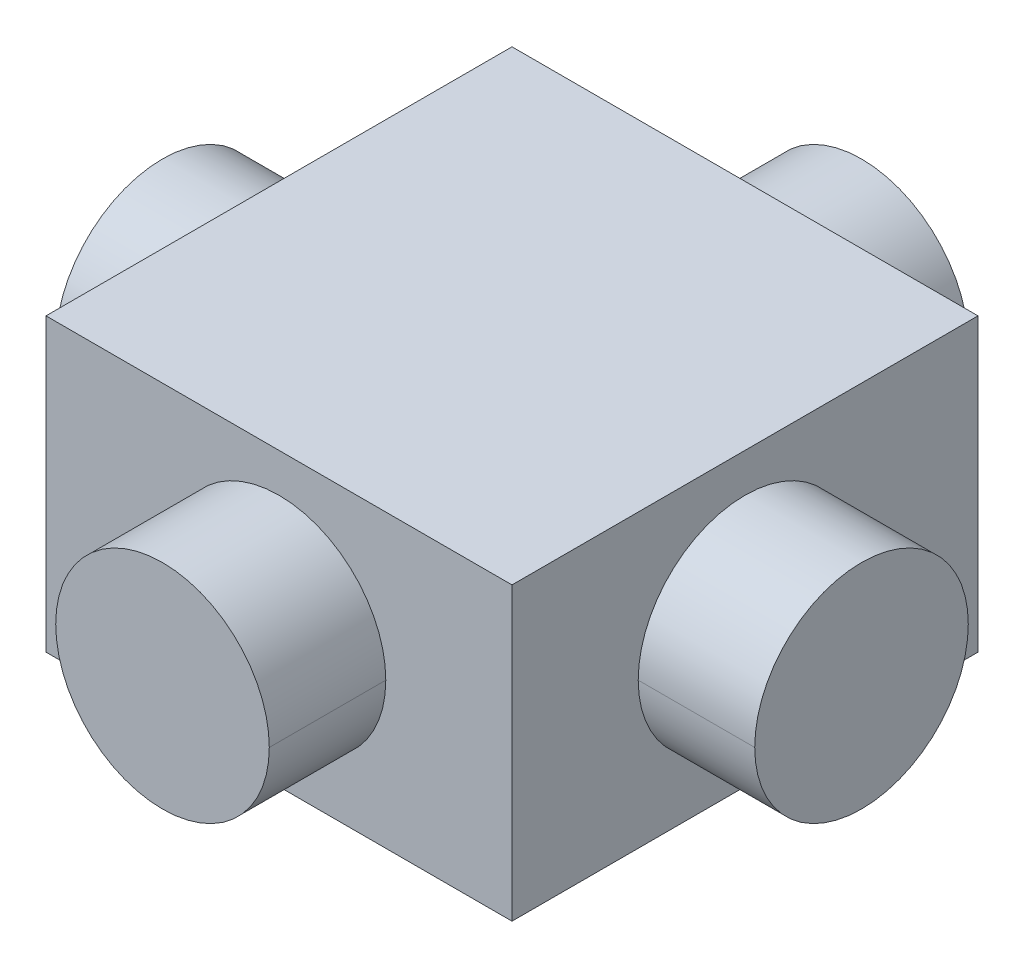
ISO-10303-21;
HEADER;
FILE_DESCRIPTION(('STEP AP214'),'2;1');
FILE_NAME('part.step','',(''),(''),'','','');
FILE_SCHEMA(('AUTOMOTIVE_DESIGN { 1 0 10303 214 1 1 1 1 }'));
ENDSEC;
DATA;
#1=APPLICATION_CONTEXT('core data for automotive mechanical design processes');
#2=APPLICATION_PROTOCOL_DEFINITION('international standard','automotive_design',2000,#1);
#3=PRODUCT_CONTEXT('',#1,'mechanical');
#4=PRODUCT('Part','Part','',(#3));
#5=PRODUCT_RELATED_PRODUCT_CATEGORY('part','',(#4));
#6=PRODUCT_DEFINITION_FORMATION('','',#4);
#7=PRODUCT_DEFINITION_CONTEXT('part definition',#1,'design');
#8=PRODUCT_DEFINITION('design','',#6,#7);
#9=PRODUCT_DEFINITION_SHAPE('','',#8);
#10=(LENGTH_UNIT() NAMED_UNIT(*) SI_UNIT(.MILLI.,.METRE.));
#11=(NAMED_UNIT(*) PLANE_ANGLE_UNIT() SI_UNIT($,.RADIAN.));
#12=(NAMED_UNIT(*) SI_UNIT($,.STERADIAN.) SOLID_ANGLE_UNIT());
#13=UNCERTAINTY_MEASURE_WITH_UNIT(LENGTH_MEASURE(1.E-05),#10,'distance_accuracy_value','');
#14=(GEOMETRIC_REPRESENTATION_CONTEXT(3) GLOBAL_UNCERTAINTY_ASSIGNED_CONTEXT((#13)) GLOBAL_UNIT_ASSIGNED_CONTEXT((#10,
#11,#12)) REPRESENTATION_CONTEXT('',''));
#15=CARTESIAN_POINT('',(0.,0.,0.));
#16=DIRECTION('',(0.,0.,1.));
#17=DIRECTION('',(1.,0.,0.));
#18=AXIS2_PLACEMENT_3D('',#15,#16,#17);
#19=CARTESIAN_POINT('',(3.6,0.,0.));
#20=DIRECTION('',(-1.,0.,0.));
#21=DIRECTION('',(0.,0.,1.));
#22=AXIS2_PLACEMENT_3D('',#19,#20,#21);
#23=CYLINDRICAL_SURFACE('',#22,1.1);
#24=DIRECTION('',(-1.,0.,0.));
#25=VECTOR('',#24,1.);
#26=CARTESIAN_POINT('',(3.6,0.,-1.10000000000001));
#27=LINE('',#26,#25);
#28=CARTESIAN_POINT('',(-2.4,0.,-1.1));
#29=VERTEX_POINT('',#28);
#30=CARTESIAN_POINT('',(-3.6,0.,-1.09999999999999));
#31=VERTEX_POINT('',#30);
#32=EDGE_CURVE('E186',#29,#31,#27,.T.);
#33=ORIENTED_EDGE('',*,*,#32,.F.);
#34=CARTESIAN_POINT('',(-2.4,0.,0.));
#35=DIRECTION('',(-1.,0.,0.));
#36=DIRECTION('',(0.,0.,1.));
#37=AXIS2_PLACEMENT_3D('',#34,#35,#36);
#38=CIRCLE('',#37,1.1);
#39=CARTESIAN_POINT('',(-2.4,0.,1.1));
#40=VERTEX_POINT('',#39);
#41=EDGE_CURVE('E182',#29,#40,#38,.T.);
#42=ORIENTED_EDGE('',*,*,#41,.T.);
#43=DIRECTION('',(-1.,0.,0.));
#44=VECTOR('',#43,1.);
#45=CARTESIAN_POINT('',(3.6,0.,1.09999999999999));
#46=LINE('',#45,#44);
#47=CARTESIAN_POINT('',(-3.6,0.,1.10000000000001));
#48=VERTEX_POINT('',#47);
#49=EDGE_CURVE('E205',#40,#48,#46,.T.);
#50=ORIENTED_EDGE('',*,*,#49,.T.);
#51=CARTESIAN_POINT('',(-3.6,0.,0.));
#52=DIRECTION('',(1.,0.,0.));
#53=DIRECTION('',(0.,0.,-1.));
#54=AXIS2_PLACEMENT_3D('',#51,#52,#53);
#55=CIRCLE('',#54,1.1);
#56=EDGE_CURVE('E11',#48,#31,#55,.T.);
#57=ORIENTED_EDGE('',*,*,#56,.T.);
#58=EDGE_LOOP('',(#33,#42,#50,#57));
#59=FACE_BOUND('',#58,.T.);
#60=ADVANCED_FACE('F16',(#59),#23,.T.);
#61=CARTESIAN_POINT('',(-3.6,0.,0.));
#62=DIRECTION('',(1.,0.,0.));
#63=DIRECTION('',(0.,0.,-1.));
#64=AXIS2_PLACEMENT_3D('',#61,#62,#63);
#65=PLANE('',#64);
#66=ORIENTED_EDGE('',*,*,#56,.F.);
#67=CARTESIAN_POINT('',(-3.6,0.,0.));
#68=DIRECTION('',(1.,0.,0.));
#69=DIRECTION('',(0.,0.,-1.));
#70=AXIS2_PLACEMENT_3D('',#67,#68,#69);
#71=CIRCLE('',#70,1.1);
#72=EDGE_CURVE('E189',#31,#48,#71,.T.);
#73=ORIENTED_EDGE('',*,*,#72,.F.);
#74=EDGE_LOOP('',(#66,#73));
#75=FACE_BOUND('',#74,.T.);
#76=ADVANCED_FACE('F310',(#75),#65,.F.);
#77=CARTESIAN_POINT('',(0.,0.,3.6));
#78=DIRECTION('',(0.,0.,-1.));
#79=DIRECTION('',(-1.,0.,0.));
#80=AXIS2_PLACEMENT_3D('',#77,#78,#79);
#81=CYLINDRICAL_SURFACE('',#80,1.1);
#82=DIRECTION('',(0.,0.,-1.));
#83=VECTOR('',#82,1.);
#84=CARTESIAN_POINT('',(1.1,0.,3.6));
#85=LINE('',#84,#83);
#86=CARTESIAN_POINT('',(1.1,0.,-2.4));
#87=VERTEX_POINT('',#86);
#88=CARTESIAN_POINT('',(1.1,0.,-3.6));
#89=VERTEX_POINT('',#88);
#90=EDGE_CURVE('E217',#87,#89,#85,.T.);
#91=ORIENTED_EDGE('',*,*,#90,.F.);
#92=CARTESIAN_POINT('',(0.,0.,-2.4));
#93=DIRECTION('',(0.,0.,1.));
#94=DIRECTION('',(1.,0.,0.));
#95=AXIS2_PLACEMENT_3D('',#92,#93,#94);
#96=CIRCLE('',#95,1.1);
#97=CARTESIAN_POINT('',(-1.1,0.,-2.4));
#98=VERTEX_POINT('',#97);
#99=EDGE_CURVE('E185',#98,#87,#96,.T.);
#100=ORIENTED_EDGE('',*,*,#99,.F.);
#101=DIRECTION('',(0.,0.,-1.));
#102=VECTOR('',#101,1.);
#103=CARTESIAN_POINT('',(-1.1,0.,3.6));
#104=LINE('',#103,#102);
#105=CARTESIAN_POINT('',(-1.1,0.,-3.6));
#106=VERTEX_POINT('',#105);
#107=EDGE_CURVE('E216',#98,#106,#104,.T.);
#108=ORIENTED_EDGE('',*,*,#107,.T.);
#109=CARTESIAN_POINT('',(0.,0.,-3.6));
#110=DIRECTION('',(0.,0.,1.));
#111=DIRECTION('',(1.,0.,0.));
#112=AXIS2_PLACEMENT_3D('',#109,#110,#111);
#113=CIRCLE('',#112,1.1);
#114=EDGE_CURVE('E27',#106,#89,#113,.T.);
#115=ORIENTED_EDGE('',*,*,#114,.T.);
#116=EDGE_LOOP('',(#91,#100,#108,#115));
#117=FACE_BOUND('',#116,.T.);
#118=ADVANCED_FACE('F18',(#117),#81,.T.);
#119=CARTESIAN_POINT('',(0.,0.,-3.6));
#120=DIRECTION('',(0.,0.,1.));
#121=DIRECTION('',(1.,0.,0.));
#122=AXIS2_PLACEMENT_3D('',#119,#120,#121);
#123=PLANE('',#122);
#124=ORIENTED_EDGE('',*,*,#114,.F.);
#125=CARTESIAN_POINT('',(0.,0.,-3.6));
#126=DIRECTION('',(0.,0.,1.));
#127=DIRECTION('',(1.,0.,0.));
#128=AXIS2_PLACEMENT_3D('',#125,#126,#127);
#129=CIRCLE('',#128,1.1);
#130=EDGE_CURVE('E213',#89,#106,#129,.T.);
#131=ORIENTED_EDGE('',*,*,#130,.F.);
#132=EDGE_LOOP('',(#124,#131));
#133=FACE_BOUND('',#132,.T.);
#134=ADVANCED_FACE('F305',(#133),#123,.F.);
#135=CARTESIAN_POINT('',(3.6,0.,0.));
#136=DIRECTION('',(-1.,0.,0.));
#137=DIRECTION('',(0.,0.,1.));
#138=AXIS2_PLACEMENT_3D('',#135,#136,#137);
#139=CYLINDRICAL_SURFACE('',#138,1.1);
#140=DIRECTION('',(-1.,0.,0.));
#141=VECTOR('',#140,1.);
#142=CARTESIAN_POINT('',(3.6,0.,-1.10000000000001));
#143=LINE('',#142,#141);
#144=CARTESIAN_POINT('',(3.6,0.,-1.10000000000001));
#145=VERTEX_POINT('',#144);
#146=CARTESIAN_POINT('',(2.4,0.,-1.1));
#147=VERTEX_POINT('',#146);
#148=EDGE_CURVE('E245',#145,#147,#143,.T.);
#149=ORIENTED_EDGE('',*,*,#148,.F.);
#150=CARTESIAN_POINT('',(3.6,0.,0.));
#151=DIRECTION('',(1.,0.,0.));
#152=DIRECTION('',(0.,0.,-1.));
#153=AXIS2_PLACEMENT_3D('',#150,#151,#152);
#154=CIRCLE('',#153,1.1);
#155=CARTESIAN_POINT('',(3.6,0.,1.09999999999999));
#156=VERTEX_POINT('',#155);
#157=EDGE_CURVE('E179',#156,#145,#154,.T.);
#158=ORIENTED_EDGE('',*,*,#157,.F.);
#159=DIRECTION('',(-1.,0.,0.));
#160=VECTOR('',#159,1.);
#161=CARTESIAN_POINT('',(3.6,0.,1.09999999999999));
#162=LINE('',#161,#160);
#163=CARTESIAN_POINT('',(2.4,0.,1.1));
#164=VERTEX_POINT('',#163);
#165=EDGE_CURVE('E20',#156,#164,#162,.T.);
#166=ORIENTED_EDGE('',*,*,#165,.T.);
#167=CARTESIAN_POINT('',(2.4,0.,0.));
#168=DIRECTION('',(-1.,0.,0.));
#169=DIRECTION('',(0.,0.,1.));
#170=AXIS2_PLACEMENT_3D('',#167,#168,#169);
#171=CIRCLE('',#170,1.1);
#172=EDGE_CURVE('E149',#147,#164,#171,.T.);
#173=ORIENTED_EDGE('',*,*,#172,.F.);
#174=EDGE_LOOP('',(#149,#158,#166,#173));
#175=FACE_BOUND('',#174,.T.);
#176=ADVANCED_FACE('F290',(#175),#139,.T.);
#177=CARTESIAN_POINT('',(3.6,0.,0.));
#178=DIRECTION('',(1.,0.,0.));
#179=DIRECTION('',(0.,0.,-1.));
#180=AXIS2_PLACEMENT_3D('',#177,#178,#179);
#181=PLANE('',#180);
#182=ORIENTED_EDGE('',*,*,#157,.T.);
#183=CARTESIAN_POINT('',(3.6,0.,0.));
#184=DIRECTION('',(1.,0.,0.));
#185=DIRECTION('',(0.,0.,-1.));
#186=AXIS2_PLACEMENT_3D('',#183,#184,#185);
#187=CIRCLE('',#186,1.1);
#188=EDGE_CURVE('E250',#145,#156,#187,.T.);
#189=ORIENTED_EDGE('',*,*,#188,.T.);
#190=EDGE_LOOP('',(#182,#189));
#191=FACE_BOUND('',#190,.T.);
#192=ADVANCED_FACE('F295',(#191),#181,.T.);
#193=CARTESIAN_POINT('',(0.,-1.5,0.));
#194=DIRECTION('',(0.,1.,0.));
#195=DIRECTION('',(1.,0.,0.));
#196=AXIS2_PLACEMENT_3D('',#193,#194,#195);
#197=PLANE('',#196);
#198=DIRECTION('',(-1.,0.,0.));
#199=VECTOR('',#198,1.);
#200=CARTESIAN_POINT('',(0.,-1.5,2.4));
#201=LINE('',#200,#199);
#202=CARTESIAN_POINT('',(2.4,-1.5,2.4));
#203=VERTEX_POINT('',#202);
#204=CARTESIAN_POINT('',(-2.4,-1.5,2.4));
#205=VERTEX_POINT('',#204);
#206=EDGE_CURVE('E178',#203,#205,#201,.T.);
#207=ORIENTED_EDGE('',*,*,#206,.T.);
#208=DIRECTION('',(0.,0.,-1.));
#209=VECTOR('',#208,1.);
#210=CARTESIAN_POINT('',(-2.4,-1.5,0.));
#211=LINE('',#210,#209);
#212=CARTESIAN_POINT('',(-2.4,-1.5,-2.4));
#213=VERTEX_POINT('',#212);
#214=EDGE_CURVE('E144',#205,#213,#211,.T.);
#215=ORIENTED_EDGE('',*,*,#214,.T.);
#216=DIRECTION('',(-1.,0.,0.));
#217=VECTOR('',#216,1.);
#218=CARTESIAN_POINT('',(0.,-1.5,-2.4));
#219=LINE('',#218,#217);
#220=CARTESIAN_POINT('',(2.4,-1.5,-2.4));
#221=VERTEX_POINT('',#220);
#222=EDGE_CURVE('E137',#221,#213,#219,.T.);
#223=ORIENTED_EDGE('',*,*,#222,.F.);
#224=DIRECTION('',(0.,0.,-1.));
#225=VECTOR('',#224,1.);
#226=CARTESIAN_POINT('',(2.4,-1.5,0.));
#227=LINE('',#226,#225);
#228=EDGE_CURVE('E142',#203,#221,#227,.T.);
#229=ORIENTED_EDGE('',*,*,#228,.F.);
#230=EDGE_LOOP('',(#207,#215,#223,#229));
#231=FACE_BOUND('',#230,.T.);
#232=ADVANCED_FACE('F140',(#231),#197,.F.);
#233=CARTESIAN_POINT('',(0.,1.5,0.));
#234=DIRECTION('',(0.,1.,0.));
#235=DIRECTION('',(1.,0.,0.));
#236=AXIS2_PLACEMENT_3D('',#233,#234,#235);
#237=PLANE('',#236);
#238=DIRECTION('',(-1.,0.,0.));
#239=VECTOR('',#238,1.);
#240=CARTESIAN_POINT('',(0.,1.5,2.4));
#241=LINE('',#240,#239);
#242=CARTESIAN_POINT('',(2.4,1.5,2.4));
#243=VERTEX_POINT('',#242);
#244=CARTESIAN_POINT('',(-2.4,1.5,2.4));
#245=VERTEX_POINT('',#244);
#246=EDGE_CURVE('E172',#243,#245,#241,.T.);
#247=ORIENTED_EDGE('',*,*,#246,.F.);
#248=DIRECTION('',(0.,0.,-1.));
#249=VECTOR('',#248,1.);
#250=CARTESIAN_POINT('',(2.4,1.5,0.));
#251=LINE('',#250,#249);
#252=CARTESIAN_POINT('',(2.4,1.5,-2.4));
#253=VERTEX_POINT('',#252);
#254=EDGE_CURVE('E158',#243,#253,#251,.T.);
#255=ORIENTED_EDGE('',*,*,#254,.T.);
#256=DIRECTION('',(-1.,0.,0.));
#257=VECTOR('',#256,1.);
#258=CARTESIAN_POINT('',(0.,1.5,-2.4));
#259=LINE('',#258,#257);
#260=CARTESIAN_POINT('',(-2.4,1.5,-2.4));
#261=VERTEX_POINT('',#260);
#262=EDGE_CURVE('E154',#253,#261,#259,.T.);
#263=ORIENTED_EDGE('',*,*,#262,.T.);
#264=DIRECTION('',(0.,0.,-1.));
#265=VECTOR('',#264,1.);
#266=CARTESIAN_POINT('',(-2.4,1.5,0.));
#267=LINE('',#266,#265);
#268=EDGE_CURVE('E42',#245,#261,#267,.T.);
#269=ORIENTED_EDGE('',*,*,#268,.F.);
#270=EDGE_LOOP('',(#247,#255,#263,#269));
#271=FACE_BOUND('',#270,.T.);
#272=ADVANCED_FACE('F303',(#271),#237,.T.);
#273=CARTESIAN_POINT('',(-2.4,1.5,0.));
#274=DIRECTION('',(-1.,0.,0.));
#275=DIRECTION('',(0.,0.,1.));
#276=AXIS2_PLACEMENT_3D('',#273,#274,#275);
#277=PLANE('',#276);
#278=CARTESIAN_POINT('',(-2.4,0.,0.));
#279=DIRECTION('',(-1.,0.,0.));
#280=DIRECTION('',(0.,0.,1.));
#281=AXIS2_PLACEMENT_3D('',#278,#279,#280);
#282=CIRCLE('',#281,1.1);
#283=EDGE_CURVE('E190',#40,#29,#282,.T.);
#284=ORIENTED_EDGE('',*,*,#283,.F.);
#285=ORIENTED_EDGE('',*,*,#41,.F.);
#286=EDGE_LOOP('',(#284,#285));
#287=FACE_BOUND('',#286,.T.);
#288=ORIENTED_EDGE('',*,*,#214,.F.);
#289=DIRECTION('',(0.,-1.,0.));
#290=VECTOR('',#289,1.);
#291=CARTESIAN_POINT('',(-2.4,1.5,2.4));
#292=LINE('',#291,#290);
#293=EDGE_CURVE('E165',#245,#205,#292,.T.);
#294=ORIENTED_EDGE('',*,*,#293,.F.);
#295=ORIENTED_EDGE('',*,*,#268,.T.);
#296=DIRECTION('',(0.,-1.,0.));
#297=VECTOR('',#296,1.);
#298=CARTESIAN_POINT('',(-2.4,1.5,-2.4));
#299=LINE('',#298,#297);
#300=EDGE_CURVE('E148',#261,#213,#299,.T.);
#301=ORIENTED_EDGE('',*,*,#300,.T.);
#302=EDGE_LOOP('',(#288,#294,#295,#301));
#303=FACE_BOUND('',#302,.T.);
#304=ADVANCED_FACE('F367',(#287,#303),#277,.T.);
#305=CARTESIAN_POINT('',(0.,1.5,-2.4));
#306=DIRECTION('',(0.,0.,1.));
#307=DIRECTION('',(1.,0.,0.));
#308=AXIS2_PLACEMENT_3D('',#305,#306,#307);
#309=PLANE('',#308);
#310=ORIENTED_EDGE('',*,*,#99,.T.);
#311=CARTESIAN_POINT('',(0.,0.,-2.4));
#312=DIRECTION('',(0.,0.,1.));
#313=DIRECTION('',(1.,0.,0.));
#314=AXIS2_PLACEMENT_3D('',#311,#312,#313);
#315=CIRCLE('',#314,1.1);
#316=EDGE_CURVE('E224',#87,#98,#315,.T.);
#317=ORIENTED_EDGE('',*,*,#316,.T.);
#318=EDGE_LOOP('',(#310,#317));
#319=FACE_BOUND('',#318,.T.);
#320=ORIENTED_EDGE('',*,*,#222,.T.);
#321=ORIENTED_EDGE('',*,*,#300,.F.);
#322=ORIENTED_EDGE('',*,*,#262,.F.);
#323=DIRECTION('',(0.,-1.,0.));
#324=VECTOR('',#323,1.);
#325=CARTESIAN_POINT('',(2.4,1.5,-2.4));
#326=LINE('',#325,#324);
#327=EDGE_CURVE('E152',#253,#221,#326,.T.);
#328=ORIENTED_EDGE('',*,*,#327,.T.);
#329=EDGE_LOOP('',(#320,#321,#322,#328));
#330=FACE_BOUND('',#329,.T.);
#331=ADVANCED_FACE('F153',(#319,#330),#309,.F.);
#332=CARTESIAN_POINT('',(2.4,1.5,0.));
#333=DIRECTION('',(-1.,0.,0.));
#334=DIRECTION('',(0.,0.,1.));
#335=AXIS2_PLACEMENT_3D('',#332,#333,#334);
#336=PLANE('',#335);
#337=CARTESIAN_POINT('',(2.4,0.,0.));
#338=DIRECTION('',(-1.,0.,0.));
#339=DIRECTION('',(0.,0.,1.));
#340=AXIS2_PLACEMENT_3D('',#337,#338,#339);
#341=CIRCLE('',#340,1.1);
#342=EDGE_CURVE('E249',#164,#147,#341,.T.);
#343=ORIENTED_EDGE('',*,*,#342,.T.);
#344=ORIENTED_EDGE('',*,*,#172,.T.);
#345=EDGE_LOOP('',(#343,#344));
#346=FACE_BOUND('',#345,.T.);
#347=ORIENTED_EDGE('',*,*,#228,.T.);
#348=ORIENTED_EDGE('',*,*,#327,.F.);
#349=ORIENTED_EDGE('',*,*,#254,.F.);
#350=DIRECTION('',(0.,-1.,0.));
#351=VECTOR('',#350,1.);
#352=CARTESIAN_POINT('',(2.4,1.5,2.4));
#353=LINE('',#352,#351);
#354=EDGE_CURVE('E162',#243,#203,#353,.T.);
#355=ORIENTED_EDGE('',*,*,#354,.T.);
#356=EDGE_LOOP('',(#347,#348,#349,#355));
#357=FACE_BOUND('',#356,.T.);
#358=ADVANCED_FACE('F160',(#346,#357),#336,.F.);
#359=CARTESIAN_POINT('',(0.,1.5,2.4));
#360=DIRECTION('',(0.,0.,1.));
#361=DIRECTION('',(1.,0.,0.));
#362=AXIS2_PLACEMENT_3D('',#359,#360,#361);
#363=PLANE('',#362);
#364=CARTESIAN_POINT('',(0.,0.,2.4));
#365=DIRECTION('',(0.,0.,1.));
#366=DIRECTION('',(1.,0.,0.));
#367=AXIS2_PLACEMENT_3D('',#364,#365,#366);
#368=CIRCLE('',#367,1.1);
#369=CARTESIAN_POINT('',(-1.1,0.,2.4));
#370=VERTEX_POINT('',#369);
#371=CARTESIAN_POINT('',(1.1,0.,2.4));
#372=VERTEX_POINT('',#371);
#373=EDGE_CURVE('E197',#370,#372,#368,.T.);
#374=ORIENTED_EDGE('',*,*,#373,.F.);
#375=CARTESIAN_POINT('',(0.,0.,2.4));
#376=DIRECTION('',(0.,0.,1.));
#377=DIRECTION('',(1.,0.,0.));
#378=AXIS2_PLACEMENT_3D('',#375,#376,#377);
#379=CIRCLE('',#378,1.1);
#380=EDGE_CURVE('E228',#372,#370,#379,.T.);
#381=ORIENTED_EDGE('',*,*,#380,.F.);
#382=EDGE_LOOP('',(#374,#381));
#383=FACE_BOUND('',#382,.T.);
#384=ORIENTED_EDGE('',*,*,#206,.F.);
#385=ORIENTED_EDGE('',*,*,#354,.F.);
#386=ORIENTED_EDGE('',*,*,#246,.T.);
#387=ORIENTED_EDGE('',*,*,#293,.T.);
#388=EDGE_LOOP('',(#384,#385,#386,#387));
#389=FACE_BOUND('',#388,.T.);
#390=ADVANCED_FACE('F338',(#383,#389),#363,.T.);
#391=CARTESIAN_POINT('',(0.,0.,3.6));
#392=DIRECTION('',(0.,0.,1.));
#393=DIRECTION('',(1.,0.,0.));
#394=AXIS2_PLACEMENT_3D('',#391,#392,#393);
#395=PLANE('',#394);
#396=CARTESIAN_POINT('',(0.,0.,3.6));
#397=DIRECTION('',(0.,0.,1.));
#398=DIRECTION('',(1.,0.,0.));
#399=AXIS2_PLACEMENT_3D('',#396,#397,#398);
#400=CIRCLE('',#399,1.1);
#401=CARTESIAN_POINT('',(-1.1,0.,3.6));
#402=VERTEX_POINT('',#401);
#403=CARTESIAN_POINT('',(1.1,0.,3.6));
#404=VERTEX_POINT('',#403);
#405=EDGE_CURVE('E194',#402,#404,#400,.T.);
#406=ORIENTED_EDGE('',*,*,#405,.T.);
#407=CARTESIAN_POINT('',(0.,0.,3.6));
#408=DIRECTION('',(0.,0.,1.));
#409=DIRECTION('',(1.,0.,0.));
#410=AXIS2_PLACEMENT_3D('',#407,#408,#409);
#411=CIRCLE('',#410,1.1);
#412=EDGE_CURVE('E208',#404,#402,#411,.T.);
#413=ORIENTED_EDGE('',*,*,#412,.T.);
#414=EDGE_LOOP('',(#406,#413));
#415=FACE_BOUND('',#414,.T.);
#416=ADVANCED_FACE('F330',(#415),#395,.T.);
#417=CARTESIAN_POINT('',(0.,0.,3.6));
#418=DIRECTION('',(0.,0.,-1.));
#419=DIRECTION('',(-1.,0.,0.));
#420=AXIS2_PLACEMENT_3D('',#417,#418,#419);
#421=CYLINDRICAL_SURFACE('',#420,1.1);
#422=DIRECTION('',(0.,0.,-1.));
#423=VECTOR('',#422,1.);
#424=CARTESIAN_POINT('',(1.1,0.,3.6));
#425=LINE('',#424,#423);
#426=EDGE_CURVE('E212',#404,#372,#425,.T.);
#427=ORIENTED_EDGE('',*,*,#426,.F.);
#428=ORIENTED_EDGE('',*,*,#405,.F.);
#429=DIRECTION('',(0.,0.,-1.));
#430=VECTOR('',#429,1.);
#431=CARTESIAN_POINT('',(-1.1,0.,3.6));
#432=LINE('',#431,#430);
#433=EDGE_CURVE('E198',#402,#370,#432,.T.);
#434=ORIENTED_EDGE('',*,*,#433,.T.);
#435=ORIENTED_EDGE('',*,*,#373,.T.);
#436=EDGE_LOOP('',(#427,#428,#434,#435));
#437=FACE_BOUND('',#436,.T.);
#438=ADVANCED_FACE('F327',(#437),#421,.T.);
#439=CARTESIAN_POINT('',(0.,0.,3.6));
#440=DIRECTION('',(0.,0.,-1.));
#441=DIRECTION('',(-1.,0.,0.));
#442=AXIS2_PLACEMENT_3D('',#439,#440,#441);
#443=CYLINDRICAL_SURFACE('',#442,1.1);
#444=ORIENTED_EDGE('',*,*,#412,.F.);
#445=ORIENTED_EDGE('',*,*,#426,.T.);
#446=ORIENTED_EDGE('',*,*,#380,.T.);
#447=ORIENTED_EDGE('',*,*,#433,.F.);
#448=EDGE_LOOP('',(#444,#445,#446,#447));
#449=FACE_BOUND('',#448,.T.);
#450=ADVANCED_FACE('F329',(#449),#443,.T.);
#451=CARTESIAN_POINT('',(3.6,0.,0.));
#452=DIRECTION('',(-1.,0.,0.));
#453=DIRECTION('',(0.,0.,1.));
#454=AXIS2_PLACEMENT_3D('',#451,#452,#453);
#455=CYLINDRICAL_SURFACE('',#454,1.1);
#456=ORIENTED_EDGE('',*,*,#188,.F.);
#457=ORIENTED_EDGE('',*,*,#148,.T.);
#458=ORIENTED_EDGE('',*,*,#342,.F.);
#459=ORIENTED_EDGE('',*,*,#165,.F.);
#460=EDGE_LOOP('',(#456,#457,#458,#459));
#461=FACE_BOUND('',#460,.T.);
#462=ADVANCED_FACE('F293',(#461),#455,.T.);
#463=CARTESIAN_POINT('',(0.,0.,3.6));
#464=DIRECTION('',(0.,0.,-1.));
#465=DIRECTION('',(-1.,0.,0.));
#466=AXIS2_PLACEMENT_3D('',#463,#464,#465);
#467=CYLINDRICAL_SURFACE('',#466,1.1);
#468=ORIENTED_EDGE('',*,*,#316,.F.);
#469=ORIENTED_EDGE('',*,*,#90,.T.);
#470=ORIENTED_EDGE('',*,*,#130,.T.);
#471=ORIENTED_EDGE('',*,*,#107,.F.);
#472=EDGE_LOOP('',(#468,#469,#470,#471));
#473=FACE_BOUND('',#472,.T.);
#474=ADVANCED_FACE('F325',(#473),#467,.T.);
#475=CARTESIAN_POINT('',(3.6,0.,0.));
#476=DIRECTION('',(-1.,0.,0.));
#477=DIRECTION('',(0.,0.,1.));
#478=AXIS2_PLACEMENT_3D('',#475,#476,#477);
#479=CYLINDRICAL_SURFACE('',#478,1.1);
#480=ORIENTED_EDGE('',*,*,#283,.T.);
#481=ORIENTED_EDGE('',*,*,#32,.T.);
#482=ORIENTED_EDGE('',*,*,#72,.T.);
#483=ORIENTED_EDGE('',*,*,#49,.F.);
#484=EDGE_LOOP('',(#480,#481,#482,#483));
#485=FACE_BOUND('',#484,.T.);
#486=ADVANCED_FACE('F322',(#485),#479,.T.);
#487=CLOSED_SHELL('',(#60,#76,#118,#134,#176,#192,#232,#272,#304,#331,#358,#390,#416,#438,#450,
#462,#474,#486));
#488=MANIFOLD_SOLID_BREP('B1',#487);
#489=ADVANCED_BREP_SHAPE_REPRESENTATION('',(#18,#488),#14);
#490=SHAPE_DEFINITION_REPRESENTATION(#9,#489);
ENDSEC;
END-ISO-10303-21;
